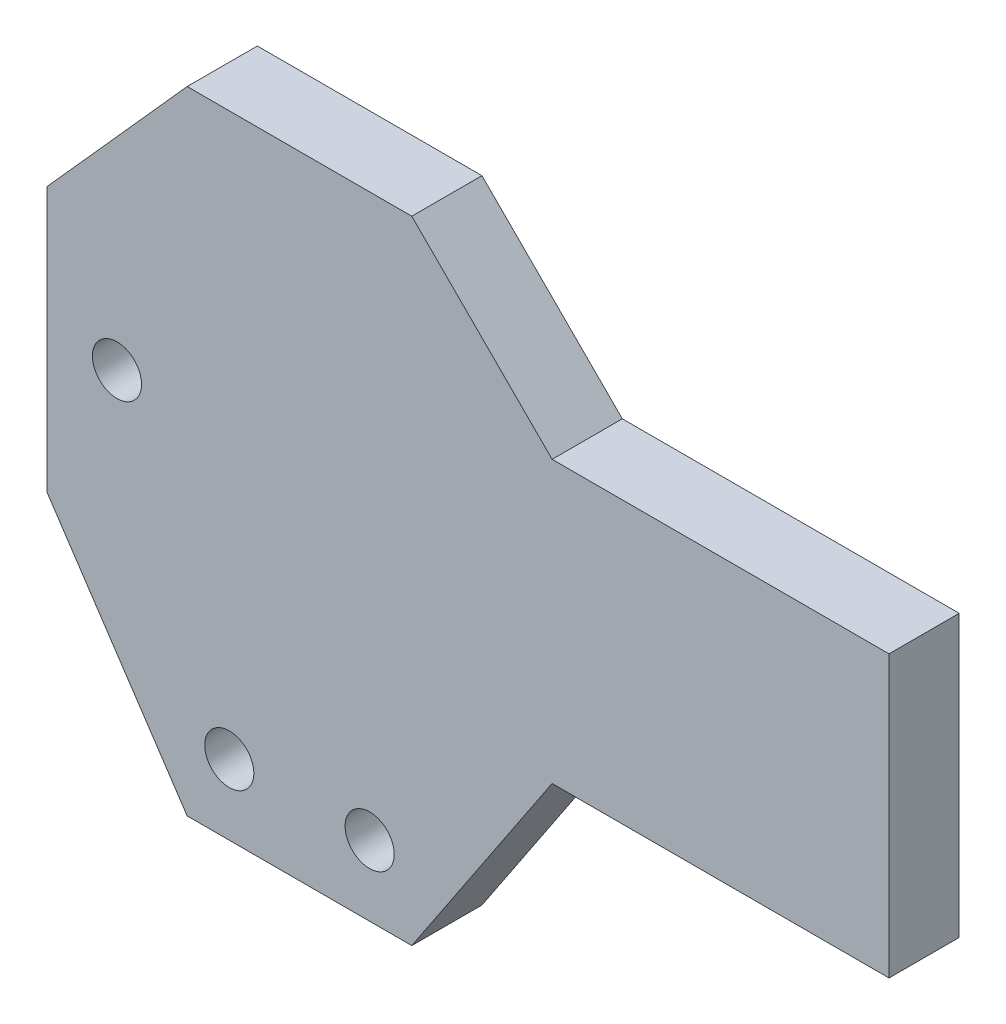
ISO-10303-21;
HEADER;
FILE_DESCRIPTION(('STEP AP214'),'2;1');
FILE_NAME('part.step','',(''),(''),'','','');
FILE_SCHEMA(('AUTOMOTIVE_DESIGN { 1 0 10303 214 1 1 1 1 }'));
ENDSEC;
DATA;
#1=APPLICATION_CONTEXT('core data for automotive mechanical design processes');
#2=APPLICATION_PROTOCOL_DEFINITION('international standard','automotive_design',2000,#1);
#3=PRODUCT_CONTEXT('',#1,'mechanical');
#4=PRODUCT('Part','Part','',(#3));
#5=PRODUCT_RELATED_PRODUCT_CATEGORY('part','',(#4));
#6=PRODUCT_DEFINITION_FORMATION('','',#4);
#7=PRODUCT_DEFINITION_CONTEXT('part definition',#1,'design');
#8=PRODUCT_DEFINITION('design','',#6,#7);
#9=PRODUCT_DEFINITION_SHAPE('','',#8);
#10=(LENGTH_UNIT() NAMED_UNIT(*) SI_UNIT(.MILLI.,.METRE.));
#11=(NAMED_UNIT(*) PLANE_ANGLE_UNIT() SI_UNIT($,.RADIAN.));
#12=(NAMED_UNIT(*) SI_UNIT($,.STERADIAN.) SOLID_ANGLE_UNIT());
#13=UNCERTAINTY_MEASURE_WITH_UNIT(LENGTH_MEASURE(1.E-05),#10,'distance_accuracy_value','');
#14=(GEOMETRIC_REPRESENTATION_CONTEXT(3) GLOBAL_UNCERTAINTY_ASSIGNED_CONTEXT((#13)) GLOBAL_UNIT_ASSIGNED_CONTEXT((#10,
#11,#12)) REPRESENTATION_CONTEXT('',''));
#15=CARTESIAN_POINT('',(0.,0.,0.));
#16=DIRECTION('',(0.,0.,1.));
#17=DIRECTION('',(1.,0.,0.));
#18=AXIS2_PLACEMENT_3D('',#15,#16,#17);
#19=CARTESIAN_POINT('',(0.,12.5,5.));
#20=DIRECTION('',(0.,1.,0.));
#21=DIRECTION('',(0.,0.,1.));
#22=AXIS2_PLACEMENT_3D('',#19,#20,#21);
#23=PLANE('',#22);
#24=DIRECTION('',(1.,0.,0.));
#25=VECTOR('',#24,1.);
#26=CARTESIAN_POINT('',(0.,12.5,0.));
#27=LINE('',#26,#25);
#28=CARTESIAN_POINT('',(6.,12.5,0.));
#29=VERTEX_POINT('',#28);
#30=CARTESIAN_POINT('',(30.,12.5,0.));
#31=VERTEX_POINT('',#30);
#32=EDGE_CURVE('E177',#29,#31,#27,.T.);
#33=ORIENTED_EDGE('',*,*,#32,.F.);
#34=DIRECTION('',(0.,0.,-1.));
#35=VECTOR('',#34,1.);
#36=CARTESIAN_POINT('',(6.,12.5,5.));
#37=LINE('',#36,#35);
#38=CARTESIAN_POINT('',(6.,12.5,5.));
#39=VERTEX_POINT('',#38);
#40=EDGE_CURVE('E11',#39,#29,#37,.T.);
#41=ORIENTED_EDGE('',*,*,#40,.F.);
#42=DIRECTION('',(1.,0.,0.));
#43=VECTOR('',#42,1.);
#44=CARTESIAN_POINT('',(0.,12.5,5.));
#45=LINE('',#44,#43);
#46=CARTESIAN_POINT('',(30.,12.5,5.));
#47=VERTEX_POINT('',#46);
#48=EDGE_CURVE('E409',#39,#47,#45,.T.);
#49=ORIENTED_EDGE('',*,*,#48,.T.);
#50=DIRECTION('',(0.,0.,-1.));
#51=VECTOR('',#50,1.);
#52=CARTESIAN_POINT('',(30.,12.5,5.));
#53=LINE('',#52,#51);
#54=EDGE_CURVE('E61',#47,#31,#53,.T.);
#55=ORIENTED_EDGE('',*,*,#54,.T.);
#56=EDGE_LOOP('',(#33,#41,#49,#55));
#57=FACE_BOUND('',#56,.T.);
#58=ADVANCED_FACE('F44',(#57),#23,.T.);
#59=CARTESIAN_POINT('',(9.25,9.25,5.));
#60=DIRECTION('',(0.707106781186547,0.707106781186548,0.));
#61=DIRECTION('',(-0.707106781186548,0.707106781186547,0.));
#62=AXIS2_PLACEMENT_3D('',#59,#60,#61);
#63=PLANE('',#62);
#64=DIRECTION('',(0.707106781186548,-0.707106781186547,0.));
#65=VECTOR('',#64,1.);
#66=CARTESIAN_POINT('',(9.25,9.25,0.));
#67=LINE('',#66,#65);
#68=CARTESIAN_POINT('',(-4.,22.5,0.));
#69=VERTEX_POINT('',#68);
#70=EDGE_CURVE('E174',#69,#29,#67,.T.);
#71=ORIENTED_EDGE('',*,*,#70,.F.);
#72=DIRECTION('',(0.,0.,-1.));
#73=VECTOR('',#72,1.);
#74=CARTESIAN_POINT('',(-4.,22.5,5.));
#75=LINE('',#74,#73);
#76=CARTESIAN_POINT('',(-4.,22.5,5.));
#77=VERTEX_POINT('',#76);
#78=EDGE_CURVE('E53',#77,#69,#75,.T.);
#79=ORIENTED_EDGE('',*,*,#78,.F.);
#80=DIRECTION('',(0.707106781186548,-0.707106781186547,0.));
#81=VECTOR('',#80,1.);
#82=CARTESIAN_POINT('',(9.25,9.25,5.));
#83=LINE('',#82,#81);
#84=EDGE_CURVE('E405',#77,#39,#83,.T.);
#85=ORIENTED_EDGE('',*,*,#84,.T.);
#86=ORIENTED_EDGE('',*,*,#40,.T.);
#87=EDGE_LOOP('',(#71,#79,#85,#86));
#88=FACE_BOUND('',#87,.T.);
#89=ADVANCED_FACE('F175',(#88),#63,.T.);
#90=CARTESIAN_POINT('',(0.,22.5,5.));
#91=DIRECTION('',(0.,1.,0.));
#92=DIRECTION('',(0.,0.,1.));
#93=AXIS2_PLACEMENT_3D('',#90,#91,#92);
#94=PLANE('',#93);
#95=DIRECTION('',(1.,0.,0.));
#96=VECTOR('',#95,1.);
#97=CARTESIAN_POINT('',(0.,22.5,0.));
#98=LINE('',#97,#96);
#99=CARTESIAN_POINT('',(-20.,22.5,0.));
#100=VERTEX_POINT('',#99);
#101=EDGE_CURVE('E166',#100,#69,#98,.T.);
#102=ORIENTED_EDGE('',*,*,#101,.F.);
#103=DIRECTION('',(0.,0.,-1.));
#104=VECTOR('',#103,1.);
#105=CARTESIAN_POINT('',(-20.,22.5,5.));
#106=LINE('',#105,#104);
#107=CARTESIAN_POINT('',(-20.,22.5,5.));
#108=VERTEX_POINT('',#107);
#109=EDGE_CURVE('E159',#108,#100,#106,.T.);
#110=ORIENTED_EDGE('',*,*,#109,.F.);
#111=DIRECTION('',(1.,0.,0.));
#112=VECTOR('',#111,1.);
#113=CARTESIAN_POINT('',(0.,22.5,5.));
#114=LINE('',#113,#112);
#115=EDGE_CURVE('E169',#108,#77,#114,.T.);
#116=ORIENTED_EDGE('',*,*,#115,.T.);
#117=ORIENTED_EDGE('',*,*,#78,.T.);
#118=EDGE_LOOP('',(#102,#110,#116,#117));
#119=FACE_BOUND('',#118,.T.);
#120=ADVANCED_FACE('F164',(#119),#94,.T.);
#121=CARTESIAN_POINT('',(-22.2914509986101,19.9380798999991,5.));
#122=DIRECTION('',(-0.74535599249993,0.666666666666667,0.));
#123=DIRECTION('',(-0.666666666666667,-0.74535599249993,0.));
#124=AXIS2_PLACEMENT_3D('',#121,#122,#123);
#125=PLANE('',#124);
#126=DIRECTION('',(0.666666666666667,0.74535599249993,0.));
#127=VECTOR('',#126,1.);
#128=CARTESIAN_POINT('',(-22.2914509986101,19.9380798999991,0.));
#129=LINE('',#128,#127);
#130=CARTESIAN_POINT('',(-30.,11.319660112501,0.));
#131=VERTEX_POINT('',#130);
#132=EDGE_CURVE('E183',#131,#100,#129,.T.);
#133=ORIENTED_EDGE('',*,*,#132,.F.);
#134=DIRECTION('',(0.,0.,-1.));
#135=VECTOR('',#134,1.);
#136=CARTESIAN_POINT('',(-30.,11.319660112501,5.));
#137=LINE('',#136,#135);
#138=CARTESIAN_POINT('',(-30.,11.319660112501,5.));
#139=VERTEX_POINT('',#138);
#140=EDGE_CURVE('E157',#139,#131,#137,.T.);
#141=ORIENTED_EDGE('',*,*,#140,.F.);
#142=DIRECTION('',(0.666666666666667,0.74535599249993,0.));
#143=VECTOR('',#142,1.);
#144=CARTESIAN_POINT('',(-22.2914509986101,19.9380798999991,5.));
#145=LINE('',#144,#143);
#146=EDGE_CURVE('E403',#139,#108,#145,.T.);
#147=ORIENTED_EDGE('',*,*,#146,.T.);
#148=ORIENTED_EDGE('',*,*,#109,.T.);
#149=EDGE_LOOP('',(#133,#141,#147,#148));
#150=FACE_BOUND('',#149,.T.);
#151=ADVANCED_FACE('F336',(#150),#125,.T.);
#152=CARTESIAN_POINT('',(-30.,0.,5.));
#153=DIRECTION('',(1.,0.,0.));
#154=DIRECTION('',(0.,1.,0.));
#155=AXIS2_PLACEMENT_3D('',#152,#153,#154);
#156=PLANE('',#155);
#157=DIRECTION('',(0.,-1.,0.));
#158=VECTOR('',#157,1.);
#159=CARTESIAN_POINT('',(-30.,0.,0.));
#160=LINE('',#159,#158);
#161=CARTESIAN_POINT('',(-30.,-7.49999999999998,0.));
#162=VERTEX_POINT('',#161);
#163=EDGE_CURVE('E185',#131,#162,#160,.T.);
#164=ORIENTED_EDGE('',*,*,#163,.T.);
#165=DIRECTION('',(0.,0.,-1.));
#166=VECTOR('',#165,1.);
#167=CARTESIAN_POINT('',(-30.,-7.49999999999998,5.));
#168=LINE('',#167,#166);
#169=CARTESIAN_POINT('',(-30.,-7.49999999999998,5.));
#170=VERTEX_POINT('',#169);
#171=EDGE_CURVE('E154',#170,#162,#168,.T.);
#172=ORIENTED_EDGE('',*,*,#171,.F.);
#173=DIRECTION('',(0.,-1.,0.));
#174=VECTOR('',#173,1.);
#175=CARTESIAN_POINT('',(-30.,0.,5.));
#176=LINE('',#175,#174);
#177=EDGE_CURVE('E407',#139,#170,#176,.T.);
#178=ORIENTED_EDGE('',*,*,#177,.F.);
#179=ORIENTED_EDGE('',*,*,#140,.T.);
#180=EDGE_LOOP('',(#164,#172,#178,#179));
#181=FACE_BOUND('',#180,.T.);
#182=ADVANCED_FACE('F325',(#181),#156,.F.);
#183=CARTESIAN_POINT('',(-24.2307692307692,-16.1538461538461,5.));
#184=DIRECTION('',(0.832050294337844,0.554700196225229,0.));
#185=DIRECTION('',(-0.554700196225229,0.832050294337844,0.));
#186=AXIS2_PLACEMENT_3D('',#183,#184,#185);
#187=PLANE('',#186);
#188=DIRECTION('',(0.554700196225229,-0.832050294337844,0.));
#189=VECTOR('',#188,1.);
#190=CARTESIAN_POINT('',(-24.2307692307692,-16.1538461538461,0.));
#191=LINE('',#190,#189);
#192=CARTESIAN_POINT('',(-20.,-22.5,0.));
#193=VERTEX_POINT('',#192);
#194=EDGE_CURVE('E191',#162,#193,#191,.T.);
#195=ORIENTED_EDGE('',*,*,#194,.T.);
#196=DIRECTION('',(0.,0.,-1.));
#197=VECTOR('',#196,1.);
#198=CARTESIAN_POINT('',(-20.,-22.5,5.));
#199=LINE('',#198,#197);
#200=CARTESIAN_POINT('',(-20.,-22.5,5.));
#201=VERTEX_POINT('',#200);
#202=EDGE_CURVE('E147',#201,#193,#199,.T.);
#203=ORIENTED_EDGE('',*,*,#202,.F.);
#204=DIRECTION('',(0.554700196225229,-0.832050294337844,0.));
#205=VECTOR('',#204,1.);
#206=CARTESIAN_POINT('',(-24.2307692307692,-16.1538461538461,5.));
#207=LINE('',#206,#205);
#208=EDGE_CURVE('E414',#170,#201,#207,.T.);
#209=ORIENTED_EDGE('',*,*,#208,.F.);
#210=ORIENTED_EDGE('',*,*,#171,.T.);
#211=EDGE_LOOP('',(#195,#203,#209,#210));
#212=FACE_BOUND('',#211,.T.);
#213=ADVANCED_FACE('F314',(#212),#187,.F.);
#214=CARTESIAN_POINT('',(0.,-22.5,5.));
#215=DIRECTION('',(0.,1.,0.));
#216=DIRECTION('',(0.,0.,1.));
#217=AXIS2_PLACEMENT_3D('',#214,#215,#216);
#218=PLANE('',#217);
#219=DIRECTION('',(1.,0.,0.));
#220=VECTOR('',#219,1.);
#221=CARTESIAN_POINT('',(0.,-22.5,0.));
#222=LINE('',#221,#220);
#223=CARTESIAN_POINT('',(-3.99999999999999,-22.5,0.));
#224=VERTEX_POINT('',#223);
#225=EDGE_CURVE('E194',#193,#224,#222,.T.);
#226=ORIENTED_EDGE('',*,*,#225,.T.);
#227=DIRECTION('',(0.,0.,-1.));
#228=VECTOR('',#227,1.);
#229=CARTESIAN_POINT('',(-3.99999999999999,-22.5,5.));
#230=LINE('',#229,#228);
#231=CARTESIAN_POINT('',(-3.99999999999999,-22.5,5.));
#232=VERTEX_POINT('',#231);
#233=EDGE_CURVE('E145',#232,#224,#230,.T.);
#234=ORIENTED_EDGE('',*,*,#233,.F.);
#235=DIRECTION('',(1.,0.,0.));
#236=VECTOR('',#235,1.);
#237=CARTESIAN_POINT('',(0.,-22.5,5.));
#238=LINE('',#237,#236);
#239=EDGE_CURVE('E138',#201,#232,#238,.T.);
#240=ORIENTED_EDGE('',*,*,#239,.F.);
#241=ORIENTED_EDGE('',*,*,#202,.T.);
#242=EDGE_LOOP('',(#226,#234,#240,#241));
#243=FACE_BOUND('',#242,.T.);
#244=ADVANCED_FACE('F304',(#243),#218,.F.);
#245=CARTESIAN_POINT('',(7.61538461538462,-5.07692307692308,5.));
#246=DIRECTION('',(-0.832050294337844,0.554700196225229,0.));
#247=DIRECTION('',(-0.554700196225229,-0.832050294337844,0.));
#248=AXIS2_PLACEMENT_3D('',#245,#246,#247);
#249=PLANE('',#248);
#250=DIRECTION('',(0.554700196225229,0.832050294337844,0.));
#251=VECTOR('',#250,1.);
#252=CARTESIAN_POINT('',(7.61538461538462,-5.07692307692308,0.));
#253=LINE('',#252,#251);
#254=CARTESIAN_POINT('',(6.00000000000001,-7.5,0.));
#255=VERTEX_POINT('',#254);
#256=EDGE_CURVE('E144',#224,#255,#253,.T.);
#257=ORIENTED_EDGE('',*,*,#256,.T.);
#258=DIRECTION('',(0.,0.,-1.));
#259=VECTOR('',#258,1.);
#260=CARTESIAN_POINT('',(6.00000000000001,-7.5,5.));
#261=LINE('',#260,#259);
#262=CARTESIAN_POINT('',(6.00000000000001,-7.5,5.));
#263=VERTEX_POINT('',#262);
#264=EDGE_CURVE('E127',#263,#255,#261,.T.);
#265=ORIENTED_EDGE('',*,*,#264,.F.);
#266=DIRECTION('',(0.554700196225229,0.832050294337844,0.));
#267=VECTOR('',#266,1.);
#268=CARTESIAN_POINT('',(7.61538461538462,-5.07692307692308,5.));
#269=LINE('',#268,#267);
#270=EDGE_CURVE('E132',#232,#263,#269,.T.);
#271=ORIENTED_EDGE('',*,*,#270,.F.);
#272=ORIENTED_EDGE('',*,*,#233,.T.);
#273=EDGE_LOOP('',(#257,#265,#271,#272));
#274=FACE_BOUND('',#273,.T.);
#275=ADVANCED_FACE('F143',(#274),#249,.F.);
#276=CARTESIAN_POINT('',(0.,-7.5,5.));
#277=DIRECTION('',(0.,1.,0.));
#278=DIRECTION('',(0.,0.,1.));
#279=AXIS2_PLACEMENT_3D('',#276,#277,#278);
#280=PLANE('',#279);
#281=DIRECTION('',(1.,0.,0.));
#282=VECTOR('',#281,1.);
#283=CARTESIAN_POINT('',(0.,-7.5,0.));
#284=LINE('',#283,#282);
#285=CARTESIAN_POINT('',(30.,-7.5,0.));
#286=VERTEX_POINT('',#285);
#287=EDGE_CURVE('E198',#255,#286,#284,.T.);
#288=ORIENTED_EDGE('',*,*,#287,.T.);
#289=DIRECTION('',(0.,0.,-1.));
#290=VECTOR('',#289,1.);
#291=CARTESIAN_POINT('',(30.,-7.5,5.));
#292=LINE('',#291,#290);
#293=CARTESIAN_POINT('',(30.,-7.5,5.));
#294=VERTEX_POINT('',#293);
#295=EDGE_CURVE('E93',#294,#286,#292,.T.);
#296=ORIENTED_EDGE('',*,*,#295,.F.);
#297=DIRECTION('',(1.,0.,0.));
#298=VECTOR('',#297,1.);
#299=CARTESIAN_POINT('',(0.,-7.5,5.));
#300=LINE('',#299,#298);
#301=EDGE_CURVE('E123',#263,#294,#300,.T.);
#302=ORIENTED_EDGE('',*,*,#301,.F.);
#303=ORIENTED_EDGE('',*,*,#264,.T.);
#304=EDGE_LOOP('',(#288,#296,#302,#303));
#305=FACE_BOUND('',#304,.T.);
#306=ADVANCED_FACE('F125',(#305),#280,.F.);
#307=CARTESIAN_POINT('',(-17.,-17.5,5.));
#308=DIRECTION('',(0.,0.,-1.));
#309=DIRECTION('',(-1.,0.,0.));
#310=AXIS2_PLACEMENT_3D('',#307,#308,#309);
#311=CYLINDRICAL_SURFACE('',#310,1.75);
#312=CARTESIAN_POINT('',(-17.,-17.5,5.));
#313=DIRECTION('',(0.,0.,1.));
#314=DIRECTION('',(1.,0.,0.));
#315=AXIS2_PLACEMENT_3D('',#312,#313,#314);
#316=CIRCLE('',#315,1.75);
#317=CARTESIAN_POINT('',(-15.25,-17.5,5.));
#318=VERTEX_POINT('',#317);
#319=EDGE_CURVE('E419',#318,#318,#316,.T.);
#320=ORIENTED_EDGE('',*,*,#319,.T.);
#321=EDGE_LOOP('',(#320));
#322=FACE_BOUND('',#321,.T.);
#323=CARTESIAN_POINT('',(-17.,-17.5,0.));
#324=DIRECTION('',(0.,0.,1.));
#325=DIRECTION('',(1.,0.,0.));
#326=AXIS2_PLACEMENT_3D('',#323,#324,#325);
#327=CIRCLE('',#326,1.75);
#328=CARTESIAN_POINT('',(-15.25,-17.5,0.));
#329=VERTEX_POINT('',#328);
#330=EDGE_CURVE('E211',#329,#329,#327,.T.);
#331=ORIENTED_EDGE('',*,*,#330,.F.);
#332=EDGE_LOOP('',(#331));
#333=FACE_BOUND('',#332,.T.);
#334=ADVANCED_FACE('F233',(#322,#333),#311,.F.);
#335=CARTESIAN_POINT('',(-6.99999999999999,-17.5,5.));
#336=DIRECTION('',(0.,0.,-1.));
#337=DIRECTION('',(-1.,0.,0.));
#338=AXIS2_PLACEMENT_3D('',#335,#336,#337);
#339=CYLINDRICAL_SURFACE('',#338,1.75);
#340=CARTESIAN_POINT('',(-6.99999999999999,-17.5,5.));
#341=DIRECTION('',(0.,0.,1.));
#342=DIRECTION('',(1.,0.,0.));
#343=AXIS2_PLACEMENT_3D('',#340,#341,#342);
#344=CIRCLE('',#343,1.75);
#345=CARTESIAN_POINT('',(-5.24999999999999,-17.5,5.));
#346=VERTEX_POINT('',#345);
#347=EDGE_CURVE('E243',#346,#346,#344,.T.);
#348=ORIENTED_EDGE('',*,*,#347,.T.);
#349=EDGE_LOOP('',(#348));
#350=FACE_BOUND('',#349,.T.);
#351=CARTESIAN_POINT('',(-6.99999999999999,-17.5,0.));
#352=DIRECTION('',(0.,0.,1.));
#353=DIRECTION('',(1.,0.,0.));
#354=AXIS2_PLACEMENT_3D('',#351,#352,#353);
#355=CIRCLE('',#354,1.75);
#356=CARTESIAN_POINT('',(-5.24999999999999,-17.5,0.));
#357=VERTEX_POINT('',#356);
#358=EDGE_CURVE('E208',#357,#357,#355,.T.);
#359=ORIENTED_EDGE('',*,*,#358,.F.);
#360=EDGE_LOOP('',(#359));
#361=FACE_BOUND('',#360,.T.);
#362=ADVANCED_FACE('F221',(#350,#361),#339,.F.);
#363=CARTESIAN_POINT('',(-25.,2.5,5.));
#364=DIRECTION('',(0.,0.,-1.));
#365=DIRECTION('',(-1.,0.,0.));
#366=AXIS2_PLACEMENT_3D('',#363,#364,#365);
#367=CYLINDRICAL_SURFACE('',#366,1.75);
#368=CARTESIAN_POINT('',(-25.,2.5,5.));
#369=DIRECTION('',(0.,0.,1.));
#370=DIRECTION('',(1.,0.,0.));
#371=AXIS2_PLACEMENT_3D('',#368,#369,#370);
#372=CIRCLE('',#371,1.75);
#373=CARTESIAN_POINT('',(-23.25,2.5,5.));
#374=VERTEX_POINT('',#373);
#375=EDGE_CURVE('E202',#374,#374,#372,.T.);
#376=ORIENTED_EDGE('',*,*,#375,.T.);
#377=EDGE_LOOP('',(#376));
#378=FACE_BOUND('',#377,.T.);
#379=CARTESIAN_POINT('',(-25.,2.5,0.));
#380=DIRECTION('',(0.,0.,1.));
#381=DIRECTION('',(1.,0.,0.));
#382=AXIS2_PLACEMENT_3D('',#379,#380,#381);
#383=CIRCLE('',#382,1.75);
#384=CARTESIAN_POINT('',(-23.25,2.5,0.));
#385=VERTEX_POINT('',#384);
#386=EDGE_CURVE('E205',#385,#385,#383,.T.);
#387=ORIENTED_EDGE('',*,*,#386,.F.);
#388=EDGE_LOOP('',(#387));
#389=FACE_BOUND('',#388,.T.);
#390=ADVANCED_FACE('F46',(#378,#389),#367,.F.);
#391=CARTESIAN_POINT('',(30.,0.,5.));
#392=DIRECTION('',(1.,0.,0.));
#393=DIRECTION('',(0.,1.,0.));
#394=AXIS2_PLACEMENT_3D('',#391,#392,#393);
#395=PLANE('',#394);
#396=DIRECTION('',(0.,-1.,0.));
#397=VECTOR('',#396,1.);
#398=CARTESIAN_POINT('',(30.,0.,0.));
#399=LINE('',#398,#397);
#400=EDGE_CURVE('E200',#31,#286,#399,.T.);
#401=ORIENTED_EDGE('',*,*,#400,.F.);
#402=ORIENTED_EDGE('',*,*,#54,.F.);
#403=DIRECTION('',(0.,-1.,0.));
#404=VECTOR('',#403,1.);
#405=CARTESIAN_POINT('',(30.,0.,5.));
#406=LINE('',#405,#404);
#407=EDGE_CURVE('E131',#47,#294,#406,.T.);
#408=ORIENTED_EDGE('',*,*,#407,.T.);
#409=ORIENTED_EDGE('',*,*,#295,.T.);
#410=EDGE_LOOP('',(#401,#402,#408,#409));
#411=FACE_BOUND('',#410,.T.);
#412=ADVANCED_FACE('F213',(#411),#395,.T.);
#413=CARTESIAN_POINT('',(0.,0.,5.));
#414=DIRECTION('',(0.,0.,1.));
#415=DIRECTION('',(1.,0.,0.));
#416=AXIS2_PLACEMENT_3D('',#413,#414,#415);
#417=PLANE('',#416);
#418=ORIENTED_EDGE('',*,*,#270,.T.);
#419=ORIENTED_EDGE('',*,*,#301,.T.);
#420=ORIENTED_EDGE('',*,*,#407,.F.);
#421=ORIENTED_EDGE('',*,*,#48,.F.);
#422=ORIENTED_EDGE('',*,*,#84,.F.);
#423=ORIENTED_EDGE('',*,*,#115,.F.);
#424=ORIENTED_EDGE('',*,*,#146,.F.);
#425=ORIENTED_EDGE('',*,*,#177,.T.);
#426=ORIENTED_EDGE('',*,*,#208,.T.);
#427=ORIENTED_EDGE('',*,*,#239,.T.);
#428=EDGE_LOOP('',(#418,#419,#420,#421,#422,#423,#424,#425,#426,#427));
#429=FACE_BOUND('',#428,.T.);
#430=ORIENTED_EDGE('',*,*,#375,.F.);
#431=EDGE_LOOP('',(#430));
#432=FACE_BOUND('',#431,.T.);
#433=ORIENTED_EDGE('',*,*,#347,.F.);
#434=EDGE_LOOP('',(#433));
#435=FACE_BOUND('',#434,.T.);
#436=ORIENTED_EDGE('',*,*,#319,.F.);
#437=EDGE_LOOP('',(#436));
#438=FACE_BOUND('',#437,.T.);
#439=ADVANCED_FACE('F135',(#429,#432,#435,#438),#417,.T.);
#440=CARTESIAN_POINT('',(0.,0.,0.));
#441=DIRECTION('',(0.,0.,1.));
#442=DIRECTION('',(1.,0.,0.));
#443=AXIS2_PLACEMENT_3D('',#440,#441,#442);
#444=PLANE('',#443);
#445=ORIENTED_EDGE('',*,*,#287,.F.);
#446=ORIENTED_EDGE('',*,*,#256,.F.);
#447=ORIENTED_EDGE('',*,*,#225,.F.);
#448=ORIENTED_EDGE('',*,*,#194,.F.);
#449=ORIENTED_EDGE('',*,*,#163,.F.);
#450=ORIENTED_EDGE('',*,*,#132,.T.);
#451=ORIENTED_EDGE('',*,*,#101,.T.);
#452=ORIENTED_EDGE('',*,*,#70,.T.);
#453=ORIENTED_EDGE('',*,*,#32,.T.);
#454=ORIENTED_EDGE('',*,*,#400,.T.);
#455=EDGE_LOOP('',(#445,#446,#447,#448,#449,#450,#451,#452,#453,#454));
#456=FACE_BOUND('',#455,.T.);
#457=ORIENTED_EDGE('',*,*,#386,.T.);
#458=EDGE_LOOP('',(#457));
#459=FACE_BOUND('',#458,.T.);
#460=ORIENTED_EDGE('',*,*,#358,.T.);
#461=EDGE_LOOP('',(#460));
#462=FACE_BOUND('',#461,.T.);
#463=ORIENTED_EDGE('',*,*,#330,.T.);
#464=EDGE_LOOP('',(#463));
#465=FACE_BOUND('',#464,.T.);
#466=ADVANCED_FACE('F179',(#456,#459,#462,#465),#444,.F.);
#467=CLOSED_SHELL('',(#58,#89,#120,#151,#182,#213,#244,#275,#306,#334,#362,#390,#412,#439,#466));
#468=MANIFOLD_SOLID_BREP('B2',#467);
#469=ADVANCED_BREP_SHAPE_REPRESENTATION('',(#18,#468),#14);
#470=SHAPE_DEFINITION_REPRESENTATION(#9,#469);
ENDSEC;
END-ISO-10303-21;
